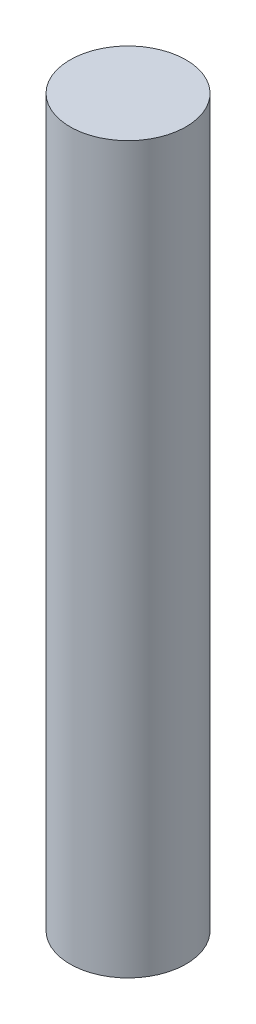
ISO-10303-21;
HEADER;
FILE_DESCRIPTION(('STEP AP214'),'2;1');
FILE_NAME('part.step','',(''),(''),'','','');
FILE_SCHEMA(('AUTOMOTIVE_DESIGN { 1 0 10303 214 1 1 1 1 }'));
ENDSEC;
DATA;
#1=APPLICATION_CONTEXT('core data for automotive mechanical design processes');
#2=APPLICATION_PROTOCOL_DEFINITION('international standard','automotive_design',2000,#1);
#3=PRODUCT_CONTEXT('',#1,'mechanical');
#4=PRODUCT('Part','Part','',(#3));
#5=PRODUCT_RELATED_PRODUCT_CATEGORY('part','',(#4));
#6=PRODUCT_DEFINITION_FORMATION('','',#4);
#7=PRODUCT_DEFINITION_CONTEXT('part definition',#1,'design');
#8=PRODUCT_DEFINITION('design','',#6,#7);
#9=PRODUCT_DEFINITION_SHAPE('','',#8);
#10=(LENGTH_UNIT() NAMED_UNIT(*) SI_UNIT(.MILLI.,.METRE.));
#11=(NAMED_UNIT(*) PLANE_ANGLE_UNIT() SI_UNIT($,.RADIAN.));
#12=(NAMED_UNIT(*) SI_UNIT($,.STERADIAN.) SOLID_ANGLE_UNIT());
#13=UNCERTAINTY_MEASURE_WITH_UNIT(LENGTH_MEASURE(1.E-05),#10,'distance_accuracy_value','');
#14=(GEOMETRIC_REPRESENTATION_CONTEXT(3) GLOBAL_UNCERTAINTY_ASSIGNED_CONTEXT((#13)) GLOBAL_UNIT_ASSIGNED_CONTEXT((#10,
#11,#12)) REPRESENTATION_CONTEXT('',''));
#15=CARTESIAN_POINT('',(0.,0.,0.));
#16=DIRECTION('',(0.,0.,1.));
#17=DIRECTION('',(1.,0.,0.));
#18=AXIS2_PLACEMENT_3D('',#15,#16,#17);
#19=CARTESIAN_POINT('',(0.,10.,0.));
#20=DIRECTION('',(0.,-1.,0.));
#21=DIRECTION('',(0.,0.,-1.));
#22=AXIS2_PLACEMENT_3D('',#19,#20,#21);
#23=CYLINDRICAL_SURFACE('',#22,4.);
#24=CARTESIAN_POINT('',(0.,50.,0.));
#25=DIRECTION('',(0.,-1.,0.));
#26=DIRECTION('',(0.,0.,-1.));
#27=AXIS2_PLACEMENT_3D('',#24,#25,#26);
#28=CIRCLE('',#27,4.);
#29=CARTESIAN_POINT('',(0.,50.,-4.));
#30=VERTEX_POINT('',#29);
#31=EDGE_CURVE('E10',#30,#30,#28,.T.);
#32=ORIENTED_EDGE('',*,*,#31,.T.);
#33=EDGE_LOOP('',(#32));
#34=FACE_BOUND('',#33,.T.);
#35=CARTESIAN_POINT('',(0.,0.,0.));
#36=DIRECTION('',(0.,-1.,0.));
#37=DIRECTION('',(0.,0.,-1.));
#38=AXIS2_PLACEMENT_3D('',#35,#36,#37);
#39=CIRCLE('',#38,4.);
#40=CARTESIAN_POINT('',(0.,0.,-4.));
#41=VERTEX_POINT('',#40);
#42=EDGE_CURVE('E42',#41,#41,#39,.T.);
#43=ORIENTED_EDGE('',*,*,#42,.F.);
#44=EDGE_LOOP('',(#43));
#45=FACE_BOUND('',#44,.T.);
#46=ADVANCED_FACE('F28',(#34,#45),#23,.T.);
#47=CARTESIAN_POINT('',(4.,50.,0.));
#48=DIRECTION('',(0.,1.,0.));
#49=DIRECTION('',(0.,0.,1.));
#50=AXIS2_PLACEMENT_3D('',#47,#48,#49);
#51=PLANE('',#50);
#52=ORIENTED_EDGE('',*,*,#31,.F.);
#53=EDGE_LOOP('',(#52));
#54=FACE_BOUND('',#53,.T.);
#55=ADVANCED_FACE('F52',(#54),#51,.T.);
#56=CARTESIAN_POINT('',(2.5,10.,0.));
#57=DIRECTION('',(0.,-1.,0.));
#58=DIRECTION('',(0.,0.,-1.));
#59=AXIS2_PLACEMENT_3D('',#56,#57,#58);
#60=PLANE('',#59);
#61=CARTESIAN_POINT('',(0.,10.,0.));
#62=DIRECTION('',(0.,-1.,0.));
#63=DIRECTION('',(0.,0.,-1.));
#64=AXIS2_PLACEMENT_3D('',#61,#62,#63);
#65=CIRCLE('',#64,2.5);
#66=CARTESIAN_POINT('',(0.,10.,-2.5));
#67=VERTEX_POINT('',#66);
#68=EDGE_CURVE('E34',#67,#67,#65,.T.);
#69=ORIENTED_EDGE('',*,*,#68,.T.);
#70=EDGE_LOOP('',(#69));
#71=FACE_BOUND('',#70,.T.);
#72=ADVANCED_FACE('F56',(#71),#60,.T.);
#73=CARTESIAN_POINT('',(0.,10.,0.));
#74=DIRECTION('',(0.,-1.,0.));
#75=DIRECTION('',(0.,0.,-1.));
#76=AXIS2_PLACEMENT_3D('',#73,#74,#75);
#77=CYLINDRICAL_SURFACE('',#76,2.5);
#78=CARTESIAN_POINT('',(0.,0.,0.));
#79=DIRECTION('',(0.,-1.,0.));
#80=DIRECTION('',(0.,0.,-1.));
#81=AXIS2_PLACEMENT_3D('',#78,#79,#80);
#82=CIRCLE('',#81,2.5);
#83=CARTESIAN_POINT('',(0.,0.,-2.5));
#84=VERTEX_POINT('',#83);
#85=EDGE_CURVE('E38',#84,#84,#82,.T.);
#86=ORIENTED_EDGE('',*,*,#85,.T.);
#87=EDGE_LOOP('',(#86));
#88=FACE_BOUND('',#87,.T.);
#89=ORIENTED_EDGE('',*,*,#68,.F.);
#90=EDGE_LOOP('',(#89));
#91=FACE_BOUND('',#90,.T.);
#92=ADVANCED_FACE('F61',(#88,#91),#77,.F.);
#93=CARTESIAN_POINT('',(2.5,0.,0.));
#94=DIRECTION('',(0.,-1.,0.));
#95=DIRECTION('',(0.,0.,-1.));
#96=AXIS2_PLACEMENT_3D('',#93,#94,#95);
#97=PLANE('',#96);
#98=ORIENTED_EDGE('',*,*,#42,.T.);
#99=EDGE_LOOP('',(#98));
#100=FACE_BOUND('',#99,.T.);
#101=ORIENTED_EDGE('',*,*,#85,.F.);
#102=EDGE_LOOP('',(#101));
#103=FACE_BOUND('',#102,.T.);
#104=ADVANCED_FACE('F48',(#100,#103),#97,.T.);
#105=CLOSED_SHELL('',(#46,#55,#72,#92,#104));
#106=MANIFOLD_SOLID_BREP('B2',#105);
#107=ADVANCED_BREP_SHAPE_REPRESENTATION('',(#18,#106),#14);
#108=SHAPE_DEFINITION_REPRESENTATION(#9,#107);
ENDSEC;
END-ISO-10303-21;
